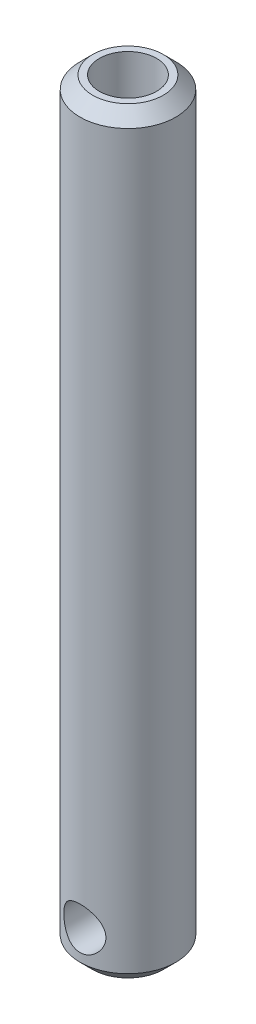
ISO-10303-21;
HEADER;
FILE_DESCRIPTION(('STEP AP214'),'2;1');
FILE_NAME('part.step','',(''),(''),'','','');
FILE_SCHEMA(('AUTOMOTIVE_DESIGN { 1 0 10303 214 1 1 1 1 }'));
ENDSEC;
DATA;
#1=APPLICATION_CONTEXT('core data for automotive mechanical design processes');
#2=APPLICATION_PROTOCOL_DEFINITION('international standard','automotive_design',2000,#1);
#3=PRODUCT_CONTEXT('',#1,'mechanical');
#4=PRODUCT('Part','Part','',(#3));
#5=PRODUCT_RELATED_PRODUCT_CATEGORY('part','',(#4));
#6=PRODUCT_DEFINITION_FORMATION('','',#4);
#7=PRODUCT_DEFINITION_CONTEXT('part definition',#1,'design');
#8=PRODUCT_DEFINITION('design','',#6,#7);
#9=PRODUCT_DEFINITION_SHAPE('','',#8);
#10=(LENGTH_UNIT() NAMED_UNIT(*) SI_UNIT(.MILLI.,.METRE.));
#11=(NAMED_UNIT(*) PLANE_ANGLE_UNIT() SI_UNIT($,.RADIAN.));
#12=(NAMED_UNIT(*) SI_UNIT($,.STERADIAN.) SOLID_ANGLE_UNIT());
#13=UNCERTAINTY_MEASURE_WITH_UNIT(LENGTH_MEASURE(1.E-05),#10,'distance_accuracy_value','');
#14=(GEOMETRIC_REPRESENTATION_CONTEXT(3) GLOBAL_UNCERTAINTY_ASSIGNED_CONTEXT((#13)) GLOBAL_UNIT_ASSIGNED_CONTEXT((#10,
#11,#12)) REPRESENTATION_CONTEXT('',''));
#15=CARTESIAN_POINT('',(0.,0.,0.));
#16=DIRECTION('',(0.,0.,1.));
#17=DIRECTION('',(1.,0.,0.));
#18=AXIS2_PLACEMENT_3D('',#15,#16,#17);
#19=CARTESIAN_POINT('',(0.,90.,0.));
#20=DIRECTION('',(0.,-1.,0.));
#21=DIRECTION('',(0.,0.,-1.));
#22=AXIS2_PLACEMENT_3D('',#19,#20,#21);
#23=CYLINDRICAL_SURFACE('',#22,5.7);
#24=CARTESIAN_POINT('',(0.,7.50000000000002,-5.7));
#25=CARTESIAN_POINT('',(-0.133281744670985,7.49999322605915,-5.69999455466434));
#26=CARTESIAN_POINT('',(-0.266780347133542,7.48927828670884,-5.69527251969802));
#27=CARTESIAN_POINT('',(-0.529945024883707,7.44683648082576,-5.67685257050834));
#28=CARTESIAN_POINT('',(-0.659600900110206,7.41505815714066,-5.6631326756791));
#29=CARTESIAN_POINT('',(-0.910858989963284,7.33190466077662,-5.62817619152404));
#30=CARTESIAN_POINT('',(-1.0324878819344,7.28059868222169,-5.60696616161432));
#31=CARTESIAN_POINT('',(-1.26528162884662,7.16015072161653,-5.55906515062101));
#32=CARTESIAN_POINT('',(-1.37644902597943,7.0910130880962,-5.53237550615095));
#33=CARTESIAN_POINT('',(-1.59140205182815,6.93290314956313,-5.4745263959192));
#34=CARTESIAN_POINT('',(-1.69454513534408,6.84311508005827,-5.44321059974702));
#35=CARTESIAN_POINT('',(-1.88487258142453,6.64798343257832,-5.38027168793014));
#36=CARTESIAN_POINT('',(-1.97204767718548,6.54263088563128,-5.34864840497853));
#37=CARTESIAN_POINT('',(-2.13279665206647,6.31224392240305,-5.28668309484098));
#38=CARTESIAN_POINT('',(-2.20533860246745,6.18643876217233,-5.25651134468746));
#39=CARTESIAN_POINT('',(-2.32794535576669,5.922906298979,-5.20338045765299));
#40=CARTESIAN_POINT('',(-2.3780229542377,5.78518583637355,-5.18041721708783));
#41=CARTESIAN_POINT('',(-2.4515548553402,5.50912344542712,-5.14601395247783));
#42=CARTESIAN_POINT('',(-2.4762519434044,5.37118190610515,-5.13403946550804));
#43=CARTESIAN_POINT('',(-2.50218911491952,5.09263342851571,-5.12145294584663));
#44=CARTESIAN_POINT('',(-2.50344424369888,4.95202825781695,-5.12083362527876));
#45=CARTESIAN_POINT('',(-2.48339065445133,4.68517714327356,-5.1305801633237));
#46=CARTESIAN_POINT('',(-2.46402847122779,4.55874302635015,-5.13999841611429));
#47=CARTESIAN_POINT('',(-2.4065815676873,4.31114288571986,-5.16714269521273));
#48=CARTESIAN_POINT('',(-2.36849278178488,4.18997801219717,-5.18487052550864));
#49=CARTESIAN_POINT('',(-2.27391982350882,3.9531392491352,-5.22704599752998));
#50=CARTESIAN_POINT('',(-2.21704546742789,3.83764735053222,-5.25163428729399));
#51=CARTESIAN_POINT('',(-2.08679528340439,3.61736644055474,-5.30473605410395));
#52=CARTESIAN_POINT('',(-2.01341259122378,3.51258190778198,-5.33325116201955));
#53=CARTESIAN_POINT('',(-1.84409256040484,3.30625504592623,-5.39427032403687));
#54=CARTESIAN_POINT('',(-1.7466782311967,3.20595725456648,-5.42689654059428));
#55=CARTESIAN_POINT('',(-1.53612703878041,3.02267832898804,-5.49020882475424));
#56=CARTESIAN_POINT('',(-1.42298567938625,2.939702163865,-5.5208943338666));
#57=CARTESIAN_POINT('',(-1.18006048569509,2.79132075140093,-5.57794169799951));
#58=CARTESIAN_POINT('',(-1.0498985490483,2.7264743038909,-5.60415795436277));
#59=CARTESIAN_POINT('',(-0.779068144410816,2.62004518435668,-5.64816984478993));
#60=CARTESIAN_POINT('',(-0.638406185044417,2.57844823425143,-5.66597064595136));
#61=CARTESIAN_POINT('',(-0.36092282938598,2.5224251425979,-5.69014831136277));
#62=CARTESIAN_POINT('',(-0.224499022918031,2.50633208358773,-5.69722456624974));
#63=CARTESIAN_POINT('',(0.0492746093313985,2.49673921819977,-5.70142870593801));
#64=CARTESIAN_POINT('',(0.186624116717049,2.50323200331169,-5.69855985289142));
#65=CARTESIAN_POINT('',(0.450194714876143,2.53748187416586,-5.68364188592424));
#66=CARTESIAN_POINT('',(0.576607200905758,2.56402232102876,-5.67211822957181));
#67=CARTESIAN_POINT('',(0.82301845845165,2.63586851193436,-5.64163658559082));
#68=CARTESIAN_POINT('',(0.943016441345647,2.68117655737019,-5.62267768622427));
#69=CARTESIAN_POINT('',(1.17744466846084,2.79072661102289,-5.5783784619947));
#70=CARTESIAN_POINT('',(1.29158383000034,2.85551594275908,-5.55285726979003));
#71=CARTESIAN_POINT('',(1.50778211561301,3.00159251675006,-5.49809519233416));
#72=CARTESIAN_POINT('',(1.60983598023786,3.08288690043249,-5.46885269899651));
#73=CARTESIAN_POINT('',(1.80742663793623,3.26712402525879,-5.40691752152526));
#74=CARTESIAN_POINT('',(1.90181898072705,3.37126677079572,-5.37413439910915));
#75=CARTESIAN_POINT('',(2.07215811091365,3.59434596343469,-5.31078516564348));
#76=CARTESIAN_POINT('',(2.14809889933591,3.71328720287285,-5.28021977788359));
#77=CARTESIAN_POINT('',(2.28073721326982,3.96606220981046,-5.22432275783849));
#78=CARTESIAN_POINT('',(2.336988960556,4.10015985590278,-5.19911689140316));
#79=CARTESIAN_POINT('',(2.42558828033078,4.37738879627253,-5.15838560390244));
#80=CARTESIAN_POINT('',(2.45795845405953,4.52051140979197,-5.14285103221772));
#81=CARTESIAN_POINT('',(2.49552021138138,4.79890333147995,-5.12472185013411));
#82=CARTESIAN_POINT('',(2.50274901183333,4.93383528193536,-5.12115815365554));
#83=CARTESIAN_POINT('',(2.49537986206028,5.20294104692535,-5.12475360463206));
#84=CARTESIAN_POINT('',(2.4807862488138,5.33711500678352,-5.131910621457));
#85=CARTESIAN_POINT('',(2.43195558278434,5.59295143182971,-5.1552159851556));
#86=CARTESIAN_POINT('',(2.39888748242027,5.71489087672634,-5.17082771615549));
#87=CARTESIAN_POINT('',(2.31526027400413,5.95148571235383,-5.20880671514976));
#88=CARTESIAN_POINT('',(2.26469614154799,6.06613899948295,-5.23117592348086));
#89=CARTESIAN_POINT('',(2.14384129669907,6.29285660332128,-5.28190221475029));
#90=CARTESIAN_POINT('',(2.07250382130454,6.40429676768253,-5.31054885913121));
#91=CARTESIAN_POINT('',(1.91351227926498,6.61425845934612,-5.36988538502314));
#92=CARTESIAN_POINT('',(1.82585162982657,6.7127747473029,-5.40057608764118));
#93=CARTESIAN_POINT('',(1.62795055150159,6.90266032292154,-5.46364577973974));
#94=CARTESIAN_POINT('',(1.51642993984084,6.99272802730556,-5.49594913737976));
#95=CARTESIAN_POINT('',(1.27874657865699,7.15299124009018,-5.55606372224056));
#96=CARTESIAN_POINT('',(1.15257720875529,7.22317771366598,-5.58387290467124));
#97=CARTESIAN_POINT('',(0.89032724728977,7.34043337972229,-5.63158724216616));
#98=CARTESIAN_POINT('',(0.75439159574071,7.38778275275719,-5.6515875883811));
#99=CARTESIAN_POINT('',(0.545494784516152,7.44082209760143,-5.67427338224803));
#100=CARTESIAN_POINT('',(0.475090593099655,7.45549969906323,-5.68061396293269));
#101=CARTESIAN_POINT('',(0.333113075867374,7.4787486579283,-5.69070112622471));
#102=CARTESIAN_POINT('',(0.261540608403841,7.48732430871557,-5.69444953265546));
#103=CARTESIAN_POINT('',(0.158162448485352,7.49519284469514,-5.69789292627365));
#104=CARTESIAN_POINT('',(0.126563053255347,7.49699450634091,-5.6986822164232));
#105=CARTESIAN_POINT('',(0.0633131851884886,7.49939889431417,-5.69973640258454));
#106=CARTESIAN_POINT('',(0.0316627118684528,7.50000160923269,-5.70000129360622));
#107=CARTESIAN_POINT('',(0.,7.50000000000002,-5.7));
#108=B_SPLINE_CURVE_WITH_KNOTS('',3,(#24,#25,#26,#27,#28,#29,#30,#31,#32,#33,#34,#35,#36,#37,
#38,#39,#40,#41,#42,#43,#44,#45,#46,#47,#48,#49,#50,#51,#52,#53,#54,#55,#56,#57,#58,#59,#60,#61,
#62,#63,#64,#65,#66,#67,#68,#69,#70,#71,#72,#73,#74,#75,#76,#77,#78,#79,#80,#81,#82,#83,#84,#85,
#86,#87,#88,#89,#90,#91,#92,#93,#94,#95,#96,#97,#98,#99,#100,#101,#102,#103,#104,#105,#106,
#107),.UNSPECIFIED.,.T.,.F.,(4,2,2,2,2,2,2,2,2,2,2,2,2,2,2,2,2,2,2,2,2,2,2,2,2,2,2,2,2,2,2,2,2,
2,2,2,2,2,2,2,2,4),(0.,0.399721270618806,0.800422664055073,1.19971723832613,1.59891453024514,
2.01797526313718,2.43727842697457,2.880006539596,3.32248215549391,3.74207738819752,
4.16140331042665,4.54437960585836,4.9274390830016,5.31901573172605,5.71075550166114,
6.13955541117031,6.56847816298589,7.00944473539555,7.4501402011289,7.86062954671883,
8.27098425807835,8.65825692008186,9.04557708579871,9.44499820016093,9.84459250630238,
10.2756254466588,10.7067983375862,11.1471828871503,11.5871501254444,11.990511437986,
12.3937925973012,12.7740514958197,13.1544196855304,13.5588844649688,13.9635127112133,
14.4022338473878,14.8411540372695,15.2745428948778,15.4908796841291,15.7070641060654,
15.8020218890495,15.8969805756313),.UNSPECIFIED.);
#109=CARTESIAN_POINT('',(0.,7.50000000000002,-5.7));
#110=VERTEX_POINT('',#109);
#111=EDGE_CURVE('E39',#110,#110,#108,.T.);
#112=ORIENTED_EDGE('',*,*,#111,.T.);
#113=EDGE_LOOP('',(#112));
#114=FACE_BOUND('',#113,.T.);
#115=CARTESIAN_POINT('',(2.5,5.,5.12249938994628));
#116=CARTESIAN_POINT('',(2.49999304008619,4.86741592374773,5.12250682043377));
#117=CARTESIAN_POINT('',(2.48938529929399,4.73460890474936,5.12772172235787));
#118=CARTESIAN_POINT('',(2.44740982216377,4.47289233146708,5.14788306691093));
#119=CARTESIAN_POINT('',(2.41598861836725,4.34399371163012,5.16285457155319));
#120=CARTESIAN_POINT('',(2.33387665885499,4.09434684851573,5.20048369656789));
#121=CARTESIAN_POINT('',(2.28327023107554,3.97356562226332,5.22310763470783));
#122=CARTESIAN_POINT('',(2.16447685544749,3.7422395854175,5.27344160246984));
#123=CARTESIAN_POINT('',(2.0962927512829,3.63169312299091,5.30115080919784));
#124=CARTESIAN_POINT('',(1.93924356964485,3.41627166588453,5.36067225074061));
#125=CARTESIAN_POINT('',(1.84934948352442,3.31218744734247,5.39263283127412));
#126=CARTESIAN_POINT('',(1.65358798183772,3.11998000048994,5.45584305752788));
#127=CARTESIAN_POINT('',(1.54771403998891,3.03186332593992,5.48709240674794));
#128=CARTESIAN_POINT('',(1.31663797977914,2.86990148995129,5.54719587285987));
#129=CARTESIAN_POINT('',(1.19074317963738,2.79696670064689,5.57585771283649));
#130=CARTESIAN_POINT('',(0.926983992811944,2.67365898823355,5.62571501900898));
#131=CARTESIAN_POINT('',(0.789125504775041,2.62327502114356,5.64691413888963));
#132=CARTESIAN_POINT('',(0.513674737329419,2.54942952763049,5.67840163931912));
#133=CARTESIAN_POINT('',(0.376514020448654,2.52459871907349,5.689242414569));
#134=CARTESIAN_POINT('',(0.0995739648266798,2.49811886486234,5.70081203040116));
#135=CARTESIAN_POINT('',(-0.0402041603656664,2.49645933000237,5.70154544639556));
#136=CARTESIAN_POINT('',(-0.308373728067234,2.515697600427,5.69312769788944));
#137=CARTESIAN_POINT('',(-0.436898394213447,2.53508479987499,5.68463844965612));
#138=CARTESIAN_POINT('',(-0.68865368824865,2.59324890300916,5.65966111056733));
#139=CARTESIAN_POINT('',(-0.81188392359369,2.632027241724,5.64317242772161));
#140=CARTESIAN_POINT('',(-1.05183645224356,2.72830138365691,5.60345151962708));
#141=CARTESIAN_POINT('',(-1.16843051257893,2.78607416998611,5.58012009064509));
#142=CARTESIAN_POINT('',(-1.3905758634958,2.91840649260876,5.52895216504019));
#143=CARTESIAN_POINT('',(-1.49612312596459,2.99297212123582,5.50111403444848));
#144=CARTESIAN_POINT('',(-1.70181139642335,3.16342119479032,5.44115620346553));
#145=CARTESIAN_POINT('',(-1.80091279165174,3.26050289410424,5.40887187421018));
#146=CARTESIAN_POINT('',(-1.98190784911389,3.4698995756584,5.34520958489177));
#147=CARTESIAN_POINT('',(-2.06379337638804,3.58222171835578,5.31383205933094));
#148=CARTESIAN_POINT('',(-2.21112158231827,3.82449242751155,5.25428569509996));
#149=CARTESIAN_POINT('',(-2.27578256095049,3.95496368003823,5.22629366031748));
#150=CARTESIAN_POINT('',(-2.38178081283587,4.22649198998603,5.17885426524115));
#151=CARTESIAN_POINT('',(-2.42313683999753,4.36754043188069,5.1594000372195));
#152=CARTESIAN_POINT('',(-2.47855218640739,4.64577361063023,5.13299755327841));
#153=CARTESIAN_POINT('',(-2.49430992127327,4.78254480507149,5.1252736214744));
#154=CARTESIAN_POINT('',(-2.50311374300742,5.0569661449772,5.12098211950285));
#155=CARTESIAN_POINT('',(-2.49616921802254,5.19461590362854,5.12440993770934));
#156=CARTESIAN_POINT('',(-2.46131940201832,5.45608079995922,5.14122759202543));
#157=CARTESIAN_POINT('',(-2.43500958954585,5.58016402915623,5.15385844293022));
#158=CARTESIAN_POINT('',(-2.36435194071381,5.82202315741501,5.18665067958733));
#159=CARTESIAN_POINT('',(-2.31999957254721,5.93979746342732,5.2068139571796));
#160=CARTESIAN_POINT('',(-2.21235653737369,6.17154792541897,5.25348016603597));
#161=CARTESIAN_POINT('',(-2.14831373573509,6.2851244941569,5.28022443715205));
#162=CARTESIAN_POINT('',(-2.00382958265096,6.50050036884152,5.3367292623841));
#163=CARTESIAN_POINT('',(-1.92338063563891,6.60229418537475,5.36649121037573));
#164=CARTESIAN_POINT('',(-1.73965956305028,6.80098023995051,5.42898035614816));
#165=CARTESIAN_POINT('',(-1.63496837595586,6.89655921600042,5.46172837378303));
#166=CARTESIAN_POINT('',(-1.41031720404828,7.06907260449752,5.52400035646231));
#167=CARTESIAN_POINT('',(-1.29035530694645,7.14600467835931,5.55352391685932));
#168=CARTESIAN_POINT('',(-1.0370368612187,7.27929152933361,5.60637062639849));
#169=CARTESIAN_POINT('',(-0.903590799119681,7.33549547877846,5.62964800445333));
#170=CARTESIAN_POINT('',(-0.627842232247666,7.42420124631077,5.66702021874996));
#171=CARTESIAN_POINT('',(-0.485545700181419,7.45671886464396,5.68112117556091));
#172=CARTESIAN_POINT('',(-0.207805312259123,7.49498641788139,5.69777956065871));
#173=CARTESIAN_POINT('',(-0.0726620527503314,7.50258212874061,5.70113252858363));
#174=CARTESIAN_POINT('',(0.19695672112874,7.49587271648769,5.69818985660622));
#175=CARTESIAN_POINT('',(0.331432370268801,7.4815722102508,5.69189625070918));
#176=CARTESIAN_POINT('',(0.589984369876327,7.43279674624395,5.67080678308248));
#177=CARTESIAN_POINT('',(0.714259900383804,7.3992027935277,5.65638268890301));
#178=CARTESIAN_POINT('',(0.955327178880328,7.31380887505625,5.62069490196446));
#179=CARTESIAN_POINT('',(1.07211758522044,7.26200565616558,5.59942998713157));
#180=CARTESIAN_POINT('',(1.30081622533322,7.13904186377725,5.5508710516351));
#181=CARTESIAN_POINT('',(1.41225575623667,7.06710327996728,5.52334547390286));
#182=CARTESIAN_POINT('',(1.62196923700684,6.90699771332989,5.46544329957458));
#183=CARTESIAN_POINT('',(1.7202377106372,6.81882401624383,5.43506552596967));
#184=CARTESIAN_POINT('',(1.90866923393381,6.62081754556513,5.37192705367149));
#185=CARTESIAN_POINT('',(1.99763684702579,6.50984376832958,5.33916186693926));
#186=CARTESIAN_POINT('',(2.15592705627494,6.27366246085509,5.27723615324883));
#187=CARTESIAN_POINT('',(2.22523772310131,6.14844635158385,5.24807782123016));
#188=CARTESIAN_POINT('',(2.34198507742676,5.88636954307292,5.19703950984768));
#189=CARTESIAN_POINT('',(2.38938564867834,5.74949005476783,5.1751715642586));
#190=CARTESIAN_POINT('',(2.44227023891945,5.53903810802894,5.15030797137953));
#191=CARTESIAN_POINT('',(2.45685723151418,5.46810079365448,5.14334597632634));
#192=CARTESIAN_POINT('',(2.47983713588451,5.32502513855727,5.13230722508292));
#193=CARTESIAN_POINT('',(2.48823473567262,5.252887749242,5.12822828528536));
#194=CARTESIAN_POINT('',(2.49564916561746,5.15047512038809,5.12462092673588));
#195=CARTESIAN_POINT('',(2.49727974869899,5.12041000141812,5.12382643258826));
#196=CARTESIAN_POINT('',(2.49945596896297,5.06023375829497,5.12276481405697));
#197=CARTESIAN_POINT('',(2.5000015812678,5.03012263310274,5.12249770176581));
#198=CARTESIAN_POINT('',(2.5,5.,5.12249938994628));
#199=B_SPLINE_CURVE_WITH_KNOTS('',3,(#115,#116,#117,#118,#119,#120,#121,#122,#123,#124,#125,
#126,#127,#128,#129,#130,#131,#132,#133,#134,#135,#136,#137,#138,#139,#140,#141,#142,#143,#144,
#145,#146,#147,#148,#149,#150,#151,#152,#153,#154,#155,#156,#157,#158,#159,#160,#161,#162,#163,
#164,#165,#166,#167,#168,#169,#170,#171,#172,#173,#174,#175,#176,#177,#178,#179,#180,#181,#182,
#183,#184,#185,#186,#187,#188,#189,#190,#191,#192,#193,#194,#195,#196,#197,#198),.UNSPECIFIED.,
.T.,.F.,(4,2,2,2,2,2,2,2,2,2,2,2,2,2,2,2,2,2,2,2,2,2,2,2,2,2,2,2,2,2,2,2,2,2,2,2,2,2,2,2,2,4),
(0.,0.397631540592107,0.796288534223556,1.19321318918018,1.59007367065169,2.01182918551926,
2.43375741665719,2.87635091808501,3.31872742711375,3.73592187869581,4.15292746796188,
4.54186833163009,4.93083798287505,5.32575184821575,5.7208092171922,6.1462411382453,
6.57187363771295,7.0144011497862,7.45657204170625,7.86799041890734,8.27923868231827,
8.65993575398975,9.04072850567322,9.43839568094704,9.83624738419667,10.2707137982445,
10.7052346723677,11.1428577008322,11.5801885397053,11.9842971869084,12.3883206384683,
12.77521539554,13.1621793075834,13.5668690263082,13.9717264875961,14.4075604426041,
14.8436583315848,15.2804725360068,15.4984719446433,15.7163060645023,15.8066444725129,
15.8969849518971),.UNSPECIFIED.);
#200=CARTESIAN_POINT('',(2.5,5.,5.12249938994628));
#201=VERTEX_POINT('',#200);
#202=EDGE_CURVE('E73',#201,#201,#199,.T.);
#203=ORIENTED_EDGE('',*,*,#202,.T.);
#204=EDGE_LOOP('',(#203));
#205=FACE_BOUND('',#204,.T.);
#206=CARTESIAN_POINT('',(0.,1.50000000000007,0.));
#207=DIRECTION('',(0.,1.,0.));
#208=DIRECTION('',(0.,0.,1.));
#209=AXIS2_PLACEMENT_3D('',#206,#207,#208);
#210=CIRCLE('',#209,5.7);
#211=CARTESIAN_POINT('',(0.,1.50000000000007,5.7));
#212=VERTEX_POINT('',#211);
#213=EDGE_CURVE('E65',#212,#212,#210,.T.);
#214=ORIENTED_EDGE('',*,*,#213,.T.);
#215=EDGE_LOOP('',(#214));
#216=FACE_BOUND('',#215,.T.);
#217=CARTESIAN_POINT('',(0.,88.5,0.));
#218=DIRECTION('',(0.,1.,0.));
#219=DIRECTION('',(0.,0.,1.));
#220=AXIS2_PLACEMENT_3D('',#217,#218,#219);
#221=CIRCLE('',#220,5.7);
#222=CARTESIAN_POINT('',(0.,88.5,5.7));
#223=VERTEX_POINT('',#222);
#224=EDGE_CURVE('E61',#223,#223,#221,.F.);
#225=ORIENTED_EDGE('',*,*,#224,.T.);
#226=EDGE_LOOP('',(#225));
#227=FACE_BOUND('',#226,.T.);
#228=ADVANCED_FACE('F35',(#114,#205,#216,#227),#23,.T.);
#229=CARTESIAN_POINT('',(0.,90.,0.));
#230=DIRECTION('',(0.,1.,0.));
#231=DIRECTION('',(0.,0.,1.));
#232=AXIS2_PLACEMENT_3D('',#229,#230,#231);
#233=PLANE('',#232);
#234=CARTESIAN_POINT('',(0.,90.,0.));
#235=DIRECTION('',(0.,1.,0.));
#236=DIRECTION('',(0.,0.,1.));
#237=AXIS2_PLACEMENT_3D('',#234,#235,#236);
#238=CIRCLE('',#237,4.20000000000006);
#239=CARTESIAN_POINT('',(0.,90.,4.20000000000006));
#240=VERTEX_POINT('',#239);
#241=EDGE_CURVE('E11',#240,#240,#238,.T.);
#242=ORIENTED_EDGE('',*,*,#241,.T.);
#243=EDGE_LOOP('',(#242));
#244=FACE_BOUND('',#243,.T.);
#245=CARTESIAN_POINT('',(0.,90.,0.));
#246=DIRECTION('',(0.,1.,0.));
#247=DIRECTION('',(0.,0.,1.));
#248=AXIS2_PLACEMENT_3D('',#245,#246,#247);
#249=CIRCLE('',#248,3.39999999999999);
#250=CARTESIAN_POINT('',(0.,90.,3.39999999999999));
#251=VERTEX_POINT('',#250);
#252=EDGE_CURVE('E62',#251,#251,#249,.T.);
#253=ORIENTED_EDGE('',*,*,#252,.F.);
#254=EDGE_LOOP('',(#253));
#255=FACE_BOUND('',#254,.T.);
#256=ADVANCED_FACE('F88',(#244,#255),#233,.T.);
#257=CARTESIAN_POINT('',(0.,0.,0.));
#258=DIRECTION('',(0.,1.,0.));
#259=DIRECTION('',(0.,0.,1.));
#260=AXIS2_PLACEMENT_3D('',#257,#258,#259);
#261=PLANE('',#260);
#262=CARTESIAN_POINT('',(0.,0.,0.));
#263=DIRECTION('',(0.,1.,0.));
#264=DIRECTION('',(0.,0.,1.));
#265=AXIS2_PLACEMENT_3D('',#262,#263,#264);
#266=CIRCLE('',#265,4.19999999999992);
#267=CARTESIAN_POINT('',(0.,0.,4.19999999999992));
#268=VERTEX_POINT('',#267);
#269=EDGE_CURVE('E47',#268,#268,#266,.F.);
#270=ORIENTED_EDGE('',*,*,#269,.T.);
#271=EDGE_LOOP('',(#270));
#272=FACE_BOUND('',#271,.T.);
#273=ADVANCED_FACE('F55',(#272),#261,.F.);
#274=CARTESIAN_POINT('',(0.,55.,0.));
#275=DIRECTION('',(0.,1.,0.));
#276=DIRECTION('',(0.,0.,1.));
#277=AXIS2_PLACEMENT_3D('',#274,#275,#276);
#278=CONICAL_SURFACE('',#277,3.39999999999999,1.04719755119659);
#279=CARTESIAN_POINT('',(0.,53.0370090847553,0.));
#280=VERTEX_POINT('',#279);
#281=VERTEX_LOOP('',#280);
#282=FACE_BOUND('',#281,.T.);
#283=CARTESIAN_POINT('',(0.,55.,0.));
#284=DIRECTION('',(0.,1.,0.));
#285=DIRECTION('',(0.,0.,1.));
#286=AXIS2_PLACEMENT_3D('',#283,#284,#285);
#287=CIRCLE('',#286,3.39999999999999);
#288=CARTESIAN_POINT('',(0.,55.,3.39999999999999));
#289=VERTEX_POINT('',#288);
#290=EDGE_CURVE('E59',#289,#289,#287,.T.);
#291=ORIENTED_EDGE('',*,*,#290,.T.);
#292=EDGE_LOOP('',(#291));
#293=FACE_BOUND('',#292,.T.);
#294=ADVANCED_FACE('F51',(#282,#293),#278,.F.);
#295=CARTESIAN_POINT('',(0.,90.,0.));
#296=DIRECTION('',(0.,1.,0.));
#297=DIRECTION('',(0.,0.,1.));
#298=AXIS2_PLACEMENT_3D('',#295,#296,#297);
#299=CYLINDRICAL_SURFACE('',#298,3.39999999999999);
#300=ORIENTED_EDGE('',*,*,#290,.F.);
#301=EDGE_LOOP('',(#300));
#302=FACE_BOUND('',#301,.T.);
#303=ORIENTED_EDGE('',*,*,#252,.T.);
#304=EDGE_LOOP('',(#303));
#305=FACE_BOUND('',#304,.T.);
#306=ADVANCED_FACE('F54',(#302,#305),#299,.F.);
#307=CARTESIAN_POINT('',(0.,1.50000000000007,0.));
#308=DIRECTION('',(0.,1.,0.));
#309=DIRECTION('',(0.,0.,1.));
#310=AXIS2_PLACEMENT_3D('',#307,#308,#309);
#311=CONICAL_SURFACE('',#310,5.7,0.78539816339745);
#312=ORIENTED_EDGE('',*,*,#269,.F.);
#313=EDGE_LOOP('',(#312));
#314=FACE_BOUND('',#313,.T.);
#315=ORIENTED_EDGE('',*,*,#213,.F.);
#316=EDGE_LOOP('',(#315));
#317=FACE_BOUND('',#316,.T.);
#318=ADVANCED_FACE('F86',(#314,#317),#311,.T.);
#319=CARTESIAN_POINT('',(0.,90.,0.));
#320=DIRECTION('',(0.,-1.,0.));
#321=DIRECTION('',(0.,0.,-1.));
#322=AXIS2_PLACEMENT_3D('',#319,#320,#321);
#323=CONICAL_SURFACE('',#322,4.20000000000006,0.785398163397441);
#324=ORIENTED_EDGE('',*,*,#224,.F.);
#325=EDGE_LOOP('',(#324));
#326=FACE_BOUND('',#325,.T.);
#327=ORIENTED_EDGE('',*,*,#241,.F.);
#328=EDGE_LOOP('',(#327));
#329=FACE_BOUND('',#328,.T.);
#330=ADVANCED_FACE('F37',(#326,#329),#323,.T.);
#331=CARTESIAN_POINT('',(0.,5.,-10.));
#332=DIRECTION('',(0.,0.,1.));
#333=DIRECTION('',(1.,0.,0.));
#334=AXIS2_PLACEMENT_3D('',#331,#332,#333);
#335=CYLINDRICAL_SURFACE('',#334,2.5);
#336=ORIENTED_EDGE('',*,*,#202,.F.);
#337=EDGE_LOOP('',(#336));
#338=FACE_BOUND('',#337,.T.);
#339=ORIENTED_EDGE('',*,*,#111,.F.);
#340=EDGE_LOOP('',(#339));
#341=FACE_BOUND('',#340,.T.);
#342=ADVANCED_FACE('F79',(#338,#341),#335,.F.);
#343=CLOSED_SHELL('',(#228,#256,#273,#294,#306,#318,#330,#342));
#344=MANIFOLD_SOLID_BREP('B2',#343);
#345=ADVANCED_BREP_SHAPE_REPRESENTATION('',(#18,#344),#14);
#346=SHAPE_DEFINITION_REPRESENTATION(#9,#345);
ENDSEC;
END-ISO-10303-21;
